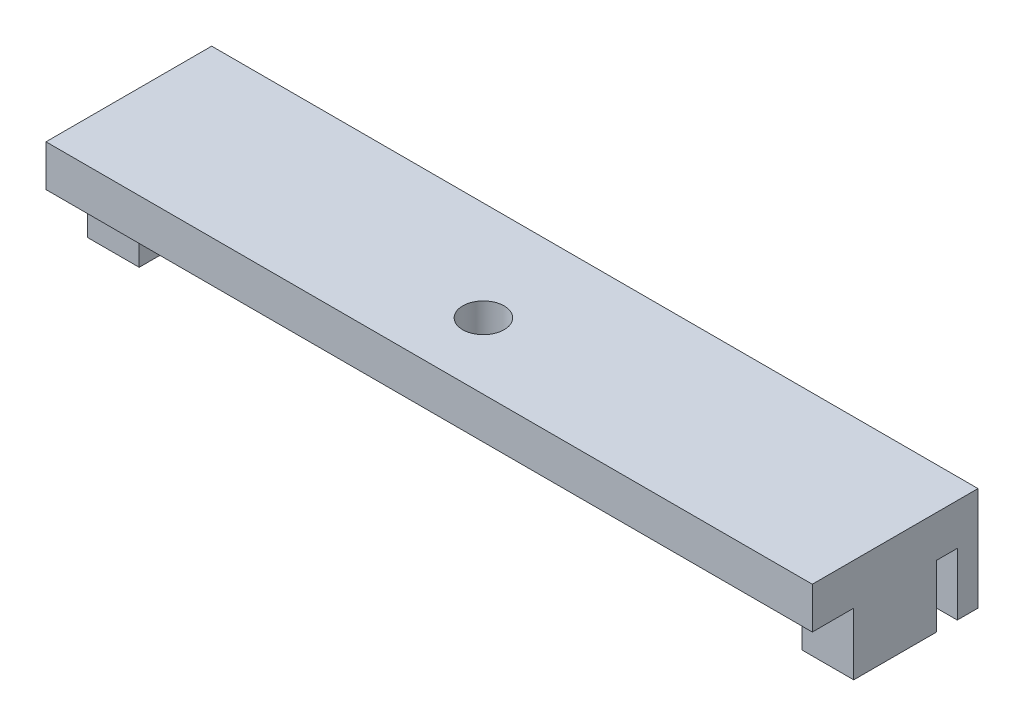
ISO-10303-21;
HEADER;
FILE_DESCRIPTION(('STEP AP214'),'2;1');
FILE_NAME('part.step','',(''),(''),'','','');
FILE_SCHEMA(('AUTOMOTIVE_DESIGN { 1 0 10303 214 1 1 1 1 }'));
ENDSEC;
DATA;
#1=APPLICATION_CONTEXT('core data for automotive mechanical design processes');
#2=APPLICATION_PROTOCOL_DEFINITION('international standard','automotive_design',2000,#1);
#3=PRODUCT_CONTEXT('',#1,'mechanical');
#4=PRODUCT('Part','Part','',(#3));
#5=PRODUCT_RELATED_PRODUCT_CATEGORY('part','',(#4));
#6=PRODUCT_DEFINITION_FORMATION('','',#4);
#7=PRODUCT_DEFINITION_CONTEXT('part definition',#1,'design');
#8=PRODUCT_DEFINITION('design','',#6,#7);
#9=PRODUCT_DEFINITION_SHAPE('','',#8);
#10=(LENGTH_UNIT() NAMED_UNIT(*) SI_UNIT(.MILLI.,.METRE.));
#11=(NAMED_UNIT(*) PLANE_ANGLE_UNIT() SI_UNIT($,.RADIAN.));
#12=(NAMED_UNIT(*) SI_UNIT($,.STERADIAN.) SOLID_ANGLE_UNIT());
#13=UNCERTAINTY_MEASURE_WITH_UNIT(LENGTH_MEASURE(1.E-05),#10,'distance_accuracy_value','');
#14=(GEOMETRIC_REPRESENTATION_CONTEXT(3) GLOBAL_UNCERTAINTY_ASSIGNED_CONTEXT((#13)) GLOBAL_UNIT_ASSIGNED_CONTEXT((#10,
#11,#12)) REPRESENTATION_CONTEXT('',''));
#15=CARTESIAN_POINT('',(0.,0.,0.));
#16=DIRECTION('',(0.,0.,1.));
#17=DIRECTION('',(1.,0.,0.));
#18=AXIS2_PLACEMENT_3D('',#15,#16,#17);
#19=CARTESIAN_POINT('',(0.,0.,0.));
#20=DIRECTION('',(0.,-1.,0.));
#21=DIRECTION('',(0.,0.,-1.));
#22=AXIS2_PLACEMENT_3D('',#19,#20,#21);
#23=PLANE('',#22);
#24=CARTESIAN_POINT('',(-0.579999999999994,0.,0.8));
#25=DIRECTION('',(0.,1.,0.));
#26=DIRECTION('',(0.,0.,1.));
#27=AXIS2_PLACEMENT_3D('',#24,#25,#26);
#28=CIRCLE('',#27,1.);
#29=CARTESIAN_POINT('',(-0.579999999999994,0.,1.8));
#30=VERTEX_POINT('',#29);
#31=EDGE_CURVE('E313',#30,#30,#28,.T.);
#32=ORIENTED_EDGE('',*,*,#31,.T.);
#33=EDGE_LOOP('',(#32));
#34=FACE_BOUND('',#33,.T.);
#35=DIRECTION('',(0.,0.,1.));
#36=VECTOR('',#35,1.);
#37=CARTESIAN_POINT('',(-16.,0.,2.));
#38=LINE('',#37,#36);
#39=CARTESIAN_POINT('',(-16.,0.,-2.));
#40=VERTEX_POINT('',#39);
#41=CARTESIAN_POINT('',(-16.,0.,2.));
#42=VERTEX_POINT('',#41);
#43=EDGE_CURVE('E171',#40,#42,#38,.T.);
#44=ORIENTED_EDGE('',*,*,#43,.F.);
#45=DIRECTION('',(1.,0.,0.));
#46=VECTOR('',#45,1.);
#47=CARTESIAN_POINT('',(-18.5,0.,-2.));
#48=LINE('',#47,#46);
#49=CARTESIAN_POINT('',(-18.5,0.,-2.));
#50=VERTEX_POINT('',#49);
#51=EDGE_CURVE('E183',#50,#40,#48,.T.);
#52=ORIENTED_EDGE('',*,*,#51,.F.);
#53=DIRECTION('',(0.,0.,1.));
#54=VECTOR('',#53,1.);
#55=CARTESIAN_POINT('',(-18.5,0.,4.));
#56=LINE('',#55,#54);
#57=CARTESIAN_POINT('',(-18.5,0.,-3.));
#58=VERTEX_POINT('',#57);
#59=EDGE_CURVE('E344',#58,#50,#56,.T.);
#60=ORIENTED_EDGE('',*,*,#59,.F.);
#61=DIRECTION('',(-1.,0.,0.));
#62=VECTOR('',#61,1.);
#63=CARTESIAN_POINT('',(-18.5,0.,-3.));
#64=LINE('',#63,#62);
#65=CARTESIAN_POINT('',(-16.,0.,-3.));
#66=VERTEX_POINT('',#65);
#67=EDGE_CURVE('E222',#66,#58,#64,.T.);
#68=ORIENTED_EDGE('',*,*,#67,.F.);
#69=DIRECTION('',(0.,0.,1.));
#70=VECTOR('',#69,1.);
#71=CARTESIAN_POINT('',(-16.,0.,-3.));
#72=LINE('',#71,#70);
#73=CARTESIAN_POINT('',(-16.,0.,-4.));
#74=VERTEX_POINT('',#73);
#75=EDGE_CURVE('E225',#74,#66,#72,.T.);
#76=ORIENTED_EDGE('',*,*,#75,.F.);
#77=DIRECTION('',(-1.,0.,0.));
#78=VECTOR('',#77,1.);
#79=CARTESIAN_POINT('',(-18.5,0.,-4.));
#80=LINE('',#79,#78);
#81=CARTESIAN_POINT('',(16.,0.,-4.));
#82=VERTEX_POINT('',#81);
#83=EDGE_CURVE('E340',#82,#74,#80,.T.);
#84=ORIENTED_EDGE('',*,*,#83,.F.);
#85=DIRECTION('',(0.,0.,-1.));
#86=VECTOR('',#85,1.);
#87=CARTESIAN_POINT('',(16.,0.,-3.));
#88=LINE('',#87,#86);
#89=CARTESIAN_POINT('',(16.,0.,-3.));
#90=VERTEX_POINT('',#89);
#91=EDGE_CURVE('E251',#90,#82,#88,.T.);
#92=ORIENTED_EDGE('',*,*,#91,.F.);
#93=DIRECTION('',(-1.,0.,0.));
#94=VECTOR('',#93,1.);
#95=CARTESIAN_POINT('',(18.5,0.,-3.));
#96=LINE('',#95,#94);
#97=CARTESIAN_POINT('',(18.5,0.,-3.));
#98=VERTEX_POINT('',#97);
#99=EDGE_CURVE('E255',#98,#90,#96,.T.);
#100=ORIENTED_EDGE('',*,*,#99,.F.);
#101=DIRECTION('',(0.,0.,-1.));
#102=VECTOR('',#101,1.);
#103=CARTESIAN_POINT('',(18.5,0.,4.));
#104=LINE('',#103,#102);
#105=CARTESIAN_POINT('',(18.5,0.,-2.));
#106=VERTEX_POINT('',#105);
#107=EDGE_CURVE('E317',#106,#98,#104,.T.);
#108=ORIENTED_EDGE('',*,*,#107,.F.);
#109=DIRECTION('',(1.,0.,0.));
#110=VECTOR('',#109,1.);
#111=CARTESIAN_POINT('',(18.5,0.,-2.));
#112=LINE('',#111,#110);
#113=CARTESIAN_POINT('',(16.,0.,-2.));
#114=VERTEX_POINT('',#113);
#115=EDGE_CURVE('E277',#114,#106,#112,.T.);
#116=ORIENTED_EDGE('',*,*,#115,.F.);
#117=DIRECTION('',(0.,0.,-1.));
#118=VECTOR('',#117,1.);
#119=CARTESIAN_POINT('',(16.,0.,2.));
#120=LINE('',#119,#118);
#121=CARTESIAN_POINT('',(16.,0.,2.));
#122=VERTEX_POINT('',#121);
#123=EDGE_CURVE('E290',#122,#114,#120,.T.);
#124=ORIENTED_EDGE('',*,*,#123,.F.);
#125=DIRECTION('',(-1.,0.,0.));
#126=VECTOR('',#125,1.);
#127=CARTESIAN_POINT('',(18.5,0.,2.));
#128=LINE('',#127,#126);
#129=CARTESIAN_POINT('',(18.5,0.,2.));
#130=VERTEX_POINT('',#129);
#131=EDGE_CURVE('E259',#130,#122,#128,.T.);
#132=ORIENTED_EDGE('',*,*,#131,.F.);
#133=CARTESIAN_POINT('',(18.5,0.,4.));
#134=VERTEX_POINT('',#133);
#135=EDGE_CURVE('E336',#134,#130,#104,.T.);
#136=ORIENTED_EDGE('',*,*,#135,.F.);
#137=DIRECTION('',(1.,0.,0.));
#138=VECTOR('',#137,1.);
#139=CARTESIAN_POINT('',(-18.5,0.,4.));
#140=LINE('',#139,#138);
#141=CARTESIAN_POINT('',(-18.5,0.,4.));
#142=VERTEX_POINT('',#141);
#143=EDGE_CURVE('E326',#142,#134,#140,.T.);
#144=ORIENTED_EDGE('',*,*,#143,.F.);
#145=CARTESIAN_POINT('',(-18.5,0.,2.));
#146=VERTEX_POINT('',#145);
#147=EDGE_CURVE('E193',#146,#142,#56,.T.);
#148=ORIENTED_EDGE('',*,*,#147,.F.);
#149=DIRECTION('',(-1.,0.,0.));
#150=VECTOR('',#149,1.);
#151=CARTESIAN_POINT('',(-18.5,0.,2.));
#152=LINE('',#151,#150);
#153=EDGE_CURVE('E184',#42,#146,#152,.T.);
#154=ORIENTED_EDGE('',*,*,#153,.F.);
#155=EDGE_LOOP('',(#44,#52,#60,#68,#76,#84,#92,#100,#108,#116,#124,#132,#136,#144,#148,#154));
#156=FACE_BOUND('',#155,.T.);
#157=ADVANCED_FACE('F43',(#34,#156),#23,.T.);
#158=CARTESIAN_POINT('',(18.5,2.,4.));
#159=DIRECTION('',(-1.,0.,0.));
#160=DIRECTION('',(0.,0.,1.));
#161=AXIS2_PLACEMENT_3D('',#158,#159,#160);
#162=PLANE('',#161);
#163=ORIENTED_EDGE('',*,*,#135,.T.);
#164=DIRECTION('',(0.,1.,0.));
#165=VECTOR('',#164,1.);
#166=CARTESIAN_POINT('',(18.5,-3.,2.));
#167=LINE('',#166,#165);
#168=CARTESIAN_POINT('',(18.5,-3.,2.));
#169=VERTEX_POINT('',#168);
#170=EDGE_CURVE('E308',#169,#130,#167,.T.);
#171=ORIENTED_EDGE('',*,*,#170,.F.);
#172=DIRECTION('',(0.,0.,1.));
#173=VECTOR('',#172,1.);
#174=CARTESIAN_POINT('',(18.5,-3.,2.));
#175=LINE('',#174,#173);
#176=CARTESIAN_POINT('',(18.5,-3.,-2.));
#177=VERTEX_POINT('',#176);
#178=EDGE_CURVE('E272',#177,#169,#175,.T.);
#179=ORIENTED_EDGE('',*,*,#178,.F.);
#180=DIRECTION('',(0.,1.,0.));
#181=VECTOR('',#180,1.);
#182=CARTESIAN_POINT('',(18.5,-3.,-2.));
#183=LINE('',#182,#181);
#184=EDGE_CURVE('E286',#177,#106,#183,.T.);
#185=ORIENTED_EDGE('',*,*,#184,.T.);
#186=ORIENTED_EDGE('',*,*,#107,.T.);
#187=DIRECTION('',(0.,1.,0.));
#188=VECTOR('',#187,1.);
#189=CARTESIAN_POINT('',(18.5,-3.,-3.));
#190=LINE('',#189,#188);
#191=CARTESIAN_POINT('',(18.5,-3.,-3.));
#192=VERTEX_POINT('',#191);
#193=EDGE_CURVE('E229',#192,#98,#190,.T.);
#194=ORIENTED_EDGE('',*,*,#193,.F.);
#195=DIRECTION('',(0.,0.,1.));
#196=VECTOR('',#195,1.);
#197=CARTESIAN_POINT('',(18.5,-3.,-3.));
#198=LINE('',#197,#196);
#199=CARTESIAN_POINT('',(18.5,-3.,-4.));
#200=VERTEX_POINT('',#199);
#201=EDGE_CURVE('E256',#200,#192,#198,.T.);
#202=ORIENTED_EDGE('',*,*,#201,.F.);
#203=DIRECTION('',(0.,-1.,0.));
#204=VECTOR('',#203,1.);
#205=CARTESIAN_POINT('',(18.5,2.,-4.));
#206=LINE('',#205,#204);
#207=CARTESIAN_POINT('',(18.5,2.,-4.));
#208=VERTEX_POINT('',#207);
#209=EDGE_CURVE('E11',#208,#200,#206,.T.);
#210=ORIENTED_EDGE('',*,*,#209,.F.);
#211=DIRECTION('',(0.,0.,-1.));
#212=VECTOR('',#211,1.);
#213=CARTESIAN_POINT('',(18.5,2.,4.));
#214=LINE('',#213,#212);
#215=CARTESIAN_POINT('',(18.5,2.,4.));
#216=VERTEX_POINT('',#215);
#217=EDGE_CURVE('E321',#216,#208,#214,.T.);
#218=ORIENTED_EDGE('',*,*,#217,.F.);
#219=DIRECTION('',(0.,-1.,0.));
#220=VECTOR('',#219,1.);
#221=CARTESIAN_POINT('',(18.5,2.,4.));
#222=LINE('',#221,#220);
#223=EDGE_CURVE('E335',#216,#134,#222,.T.);
#224=ORIENTED_EDGE('',*,*,#223,.T.);
#225=EDGE_LOOP('',(#163,#171,#179,#185,#186,#194,#202,#210,#218,#224));
#226=FACE_BOUND('',#225,.T.);
#227=ADVANCED_FACE('F45',(#226),#162,.F.);
#228=CARTESIAN_POINT('',(-18.5,2.,-4.));
#229=DIRECTION('',(0.,0.,1.));
#230=DIRECTION('',(1.,0.,0.));
#231=AXIS2_PLACEMENT_3D('',#228,#229,#230);
#232=PLANE('',#231);
#233=ORIENTED_EDGE('',*,*,#209,.T.);
#234=DIRECTION('',(1.,0.,0.));
#235=VECTOR('',#234,1.);
#236=CARTESIAN_POINT('',(18.5,-3.,-4.));
#237=LINE('',#236,#235);
#238=CARTESIAN_POINT('',(16.,-3.,-4.));
#239=VERTEX_POINT('',#238);
#240=EDGE_CURVE('E250',#239,#200,#237,.T.);
#241=ORIENTED_EDGE('',*,*,#240,.F.);
#242=DIRECTION('',(0.,1.,0.));
#243=VECTOR('',#242,1.);
#244=CARTESIAN_POINT('',(16.,-3.,-4.));
#245=LINE('',#244,#243);
#246=EDGE_CURVE('E247',#239,#82,#245,.T.);
#247=ORIENTED_EDGE('',*,*,#246,.T.);
#248=ORIENTED_EDGE('',*,*,#83,.T.);
#249=DIRECTION('',(0.,1.,0.));
#250=VECTOR('',#249,1.);
#251=CARTESIAN_POINT('',(-16.,-3.,-4.));
#252=LINE('',#251,#250);
#253=CARTESIAN_POINT('',(-16.,-3.,-4.));
#254=VERTEX_POINT('',#253);
#255=EDGE_CURVE('E205',#254,#74,#252,.T.);
#256=ORIENTED_EDGE('',*,*,#255,.F.);
#257=DIRECTION('',(1.,0.,0.));
#258=VECTOR('',#257,1.);
#259=CARTESIAN_POINT('',(-18.5,-3.,-4.));
#260=LINE('',#259,#258);
#261=CARTESIAN_POINT('',(-18.5,-3.,-4.));
#262=VERTEX_POINT('',#261);
#263=EDGE_CURVE('E235',#262,#254,#260,.T.);
#264=ORIENTED_EDGE('',*,*,#263,.F.);
#265=DIRECTION('',(0.,-1.,0.));
#266=VECTOR('',#265,1.);
#267=CARTESIAN_POINT('',(-18.5,2.,-4.));
#268=LINE('',#267,#266);
#269=CARTESIAN_POINT('',(-18.5,2.,-4.));
#270=VERTEX_POINT('',#269);
#271=EDGE_CURVE('E52',#270,#262,#268,.T.);
#272=ORIENTED_EDGE('',*,*,#271,.F.);
#273=DIRECTION('',(-1.,0.,0.));
#274=VECTOR('',#273,1.);
#275=CARTESIAN_POINT('',(-18.5,2.,-4.));
#276=LINE('',#275,#274);
#277=EDGE_CURVE('E325',#208,#270,#276,.T.);
#278=ORIENTED_EDGE('',*,*,#277,.F.);
#279=EDGE_LOOP('',(#233,#241,#247,#248,#256,#264,#272,#278));
#280=FACE_BOUND('',#279,.T.);
#281=ADVANCED_FACE('F363',(#280),#232,.F.);
#282=CARTESIAN_POINT('',(-18.5,2.,4.));
#283=DIRECTION('',(1.,0.,0.));
#284=DIRECTION('',(0.,0.,-1.));
#285=AXIS2_PLACEMENT_3D('',#282,#283,#284);
#286=PLANE('',#285);
#287=ORIENTED_EDGE('',*,*,#271,.T.);
#288=DIRECTION('',(0.,0.,-1.));
#289=VECTOR('',#288,1.);
#290=CARTESIAN_POINT('',(-18.5,-3.,-3.));
#291=LINE('',#290,#289);
#292=CARTESIAN_POINT('',(-18.5,-3.,-3.));
#293=VERTEX_POINT('',#292);
#294=EDGE_CURVE('E226',#293,#262,#291,.T.);
#295=ORIENTED_EDGE('',*,*,#294,.F.);
#296=DIRECTION('',(0.,1.,0.));
#297=VECTOR('',#296,1.);
#298=CARTESIAN_POINT('',(-18.5,-3.,-3.));
#299=LINE('',#298,#297);
#300=EDGE_CURVE('E66',#293,#58,#299,.T.);
#301=ORIENTED_EDGE('',*,*,#300,.T.);
#302=ORIENTED_EDGE('',*,*,#59,.T.);
#303=DIRECTION('',(0.,1.,0.));
#304=VECTOR('',#303,1.);
#305=CARTESIAN_POINT('',(-18.5,-3.,-2.));
#306=LINE('',#305,#304);
#307=CARTESIAN_POINT('',(-18.5,-3.,-2.));
#308=VERTEX_POINT('',#307);
#309=EDGE_CURVE('E375',#308,#50,#306,.T.);
#310=ORIENTED_EDGE('',*,*,#309,.F.);
#311=DIRECTION('',(0.,0.,-1.));
#312=VECTOR('',#311,1.);
#313=CARTESIAN_POINT('',(-18.5,-3.,2.));
#314=LINE('',#313,#312);
#315=CARTESIAN_POINT('',(-18.5,-3.,2.));
#316=VERTEX_POINT('',#315);
#317=EDGE_CURVE('E195',#316,#308,#314,.T.);
#318=ORIENTED_EDGE('',*,*,#317,.F.);
#319=DIRECTION('',(0.,1.,0.));
#320=VECTOR('',#319,1.);
#321=CARTESIAN_POINT('',(-18.5,-3.,2.));
#322=LINE('',#321,#320);
#323=EDGE_CURVE('E59',#316,#146,#322,.T.);
#324=ORIENTED_EDGE('',*,*,#323,.T.);
#325=ORIENTED_EDGE('',*,*,#147,.T.);
#326=DIRECTION('',(0.,-1.,0.));
#327=VECTOR('',#326,1.);
#328=CARTESIAN_POINT('',(-18.5,2.,4.));
#329=LINE('',#328,#327);
#330=CARTESIAN_POINT('',(-18.5,2.,4.));
#331=VERTEX_POINT('',#330);
#332=EDGE_CURVE('E352',#331,#142,#329,.T.);
#333=ORIENTED_EDGE('',*,*,#332,.F.);
#334=DIRECTION('',(0.,0.,1.));
#335=VECTOR('',#334,1.);
#336=CARTESIAN_POINT('',(-18.5,2.,4.));
#337=LINE('',#336,#335);
#338=EDGE_CURVE('E329',#270,#331,#337,.T.);
#339=ORIENTED_EDGE('',*,*,#338,.F.);
#340=EDGE_LOOP('',(#287,#295,#301,#302,#310,#318,#324,#325,#333,#339));
#341=FACE_BOUND('',#340,.T.);
#342=ADVANCED_FACE('F359',(#341),#286,.F.);
#343=CARTESIAN_POINT('',(-18.5,2.,4.));
#344=DIRECTION('',(0.,0.,-1.));
#345=DIRECTION('',(-1.,0.,0.));
#346=AXIS2_PLACEMENT_3D('',#343,#344,#345);
#347=PLANE('',#346);
#348=ORIENTED_EDGE('',*,*,#143,.T.);
#349=ORIENTED_EDGE('',*,*,#223,.F.);
#350=DIRECTION('',(1.,0.,0.));
#351=VECTOR('',#350,1.);
#352=CARTESIAN_POINT('',(-18.5,2.,4.));
#353=LINE('',#352,#351);
#354=EDGE_CURVE('E332',#331,#216,#353,.T.);
#355=ORIENTED_EDGE('',*,*,#354,.F.);
#356=ORIENTED_EDGE('',*,*,#332,.T.);
#357=EDGE_LOOP('',(#348,#349,#355,#356));
#358=FACE_BOUND('',#357,.T.);
#359=ADVANCED_FACE('F403',(#358),#347,.F.);
#360=CARTESIAN_POINT('',(0.,2.,0.));
#361=DIRECTION('',(0.,-1.,0.));
#362=DIRECTION('',(0.,0.,-1.));
#363=AXIS2_PLACEMENT_3D('',#360,#361,#362);
#364=PLANE('',#363);
#365=CARTESIAN_POINT('',(-0.579999999999994,2.,0.8));
#366=DIRECTION('',(0.,1.,0.));
#367=DIRECTION('',(0.,0.,1.));
#368=AXIS2_PLACEMENT_3D('',#365,#366,#367);
#369=CIRCLE('',#368,1.);
#370=CARTESIAN_POINT('',(-0.579999999999994,2.,1.8));
#371=VERTEX_POINT('',#370);
#372=EDGE_CURVE('E312',#371,#371,#369,.T.);
#373=ORIENTED_EDGE('',*,*,#372,.F.);
#374=EDGE_LOOP('',(#373));
#375=FACE_BOUND('',#374,.T.);
#376=ORIENTED_EDGE('',*,*,#217,.T.);
#377=ORIENTED_EDGE('',*,*,#277,.T.);
#378=ORIENTED_EDGE('',*,*,#338,.T.);
#379=ORIENTED_EDGE('',*,*,#354,.T.);
#380=EDGE_LOOP('',(#376,#377,#378,#379));
#381=FACE_BOUND('',#380,.T.);
#382=ADVANCED_FACE('F401',(#375,#381),#364,.F.);
#383=CARTESIAN_POINT('',(-0.579999999999994,0.,0.8));
#384=DIRECTION('',(0.,1.,0.));
#385=DIRECTION('',(0.,0.,1.));
#386=AXIS2_PLACEMENT_3D('',#383,#384,#385);
#387=CYLINDRICAL_SURFACE('',#386,1.);
#388=ORIENTED_EDGE('',*,*,#31,.F.);
#389=EDGE_LOOP('',(#388));
#390=FACE_BOUND('',#389,.T.);
#391=ORIENTED_EDGE('',*,*,#372,.T.);
#392=EDGE_LOOP('',(#391));
#393=FACE_BOUND('',#392,.T.);
#394=ADVANCED_FACE('F428',(#390,#393),#387,.F.);
#395=CARTESIAN_POINT('',(18.5,-3.,2.));
#396=DIRECTION('',(0.,0.,-1.));
#397=DIRECTION('',(-1.,0.,0.));
#398=AXIS2_PLACEMENT_3D('',#395,#396,#397);
#399=PLANE('',#398);
#400=ORIENTED_EDGE('',*,*,#131,.T.);
#401=DIRECTION('',(0.,1.,0.));
#402=VECTOR('',#401,1.);
#403=CARTESIAN_POINT('',(16.,-3.,2.));
#404=LINE('',#403,#402);
#405=CARTESIAN_POINT('',(16.,-3.,2.));
#406=VERTEX_POINT('',#405);
#407=EDGE_CURVE('E304',#406,#122,#404,.T.);
#408=ORIENTED_EDGE('',*,*,#407,.F.);
#409=DIRECTION('',(-1.,0.,0.));
#410=VECTOR('',#409,1.);
#411=CARTESIAN_POINT('',(18.5,-3.,2.));
#412=LINE('',#411,#410);
#413=EDGE_CURVE('E276',#169,#406,#412,.T.);
#414=ORIENTED_EDGE('',*,*,#413,.F.);
#415=ORIENTED_EDGE('',*,*,#170,.T.);
#416=EDGE_LOOP('',(#400,#408,#414,#415));
#417=FACE_BOUND('',#416,.T.);
#418=ADVANCED_FACE('F435',(#417),#399,.F.);
#419=CARTESIAN_POINT('',(16.,-3.,2.));
#420=DIRECTION('',(1.,0.,0.));
#421=DIRECTION('',(0.,0.,-1.));
#422=AXIS2_PLACEMENT_3D('',#419,#420,#421);
#423=PLANE('',#422);
#424=ORIENTED_EDGE('',*,*,#123,.T.);
#425=DIRECTION('',(0.,1.,0.));
#426=VECTOR('',#425,1.);
#427=CARTESIAN_POINT('',(16.,-3.,-2.));
#428=LINE('',#427,#426);
#429=CARTESIAN_POINT('',(16.,-3.,-2.));
#430=VERTEX_POINT('',#429);
#431=EDGE_CURVE('E300',#430,#114,#428,.T.);
#432=ORIENTED_EDGE('',*,*,#431,.F.);
#433=DIRECTION('',(0.,0.,-1.));
#434=VECTOR('',#433,1.);
#435=CARTESIAN_POINT('',(16.,-3.,2.));
#436=LINE('',#435,#434);
#437=EDGE_CURVE('E280',#406,#430,#436,.T.);
#438=ORIENTED_EDGE('',*,*,#437,.F.);
#439=ORIENTED_EDGE('',*,*,#407,.T.);
#440=EDGE_LOOP('',(#424,#432,#438,#439));
#441=FACE_BOUND('',#440,.T.);
#442=ADVANCED_FACE('F441',(#441),#423,.F.);
#443=CARTESIAN_POINT('',(18.5,-3.,-2.));
#444=DIRECTION('',(0.,0.,1.));
#445=DIRECTION('',(1.,0.,0.));
#446=AXIS2_PLACEMENT_3D('',#443,#444,#445);
#447=PLANE('',#446);
#448=ORIENTED_EDGE('',*,*,#115,.T.);
#449=ORIENTED_EDGE('',*,*,#184,.F.);
#450=DIRECTION('',(1.,0.,0.));
#451=VECTOR('',#450,1.);
#452=CARTESIAN_POINT('',(18.5,-3.,-2.));
#453=LINE('',#452,#451);
#454=EDGE_CURVE('E283',#430,#177,#453,.T.);
#455=ORIENTED_EDGE('',*,*,#454,.F.);
#456=ORIENTED_EDGE('',*,*,#431,.T.);
#457=EDGE_LOOP('',(#448,#449,#455,#456));
#458=FACE_BOUND('',#457,.T.);
#459=ADVANCED_FACE('F449',(#458),#447,.F.);
#460=CARTESIAN_POINT('',(0.,-3.,0.));
#461=DIRECTION('',(0.,1.,0.));
#462=DIRECTION('',(0.,0.,1.));
#463=AXIS2_PLACEMENT_3D('',#460,#461,#462);
#464=PLANE('',#463);
#465=ORIENTED_EDGE('',*,*,#178,.T.);
#466=ORIENTED_EDGE('',*,*,#413,.T.);
#467=ORIENTED_EDGE('',*,*,#437,.T.);
#468=ORIENTED_EDGE('',*,*,#454,.T.);
#469=EDGE_LOOP('',(#465,#466,#467,#468));
#470=FACE_BOUND('',#469,.T.);
#471=ADVANCED_FACE('F457',(#470),#464,.F.);
#472=CARTESIAN_POINT('',(18.5,-3.,-3.));
#473=DIRECTION('',(0.,0.,-1.));
#474=DIRECTION('',(-1.,0.,0.));
#475=AXIS2_PLACEMENT_3D('',#472,#473,#474);
#476=PLANE('',#475);
#477=ORIENTED_EDGE('',*,*,#99,.T.);
#478=DIRECTION('',(0.,1.,0.));
#479=VECTOR('',#478,1.);
#480=CARTESIAN_POINT('',(16.,-3.,-3.));
#481=LINE('',#480,#479);
#482=CARTESIAN_POINT('',(16.,-3.,-3.));
#483=VERTEX_POINT('',#482);
#484=EDGE_CURVE('E243',#483,#90,#481,.T.);
#485=ORIENTED_EDGE('',*,*,#484,.F.);
#486=DIRECTION('',(-1.,0.,0.));
#487=VECTOR('',#486,1.);
#488=CARTESIAN_POINT('',(18.5,-3.,-3.));
#489=LINE('',#488,#487);
#490=EDGE_CURVE('E266',#192,#483,#489,.T.);
#491=ORIENTED_EDGE('',*,*,#490,.F.);
#492=ORIENTED_EDGE('',*,*,#193,.T.);
#493=EDGE_LOOP('',(#477,#485,#491,#492));
#494=FACE_BOUND('',#493,.T.);
#495=ADVANCED_FACE('F465',(#494),#476,.F.);
#496=CARTESIAN_POINT('',(16.,-3.,-3.));
#497=DIRECTION('',(1.,0.,0.));
#498=DIRECTION('',(0.,0.,-1.));
#499=AXIS2_PLACEMENT_3D('',#496,#497,#498);
#500=PLANE('',#499);
#501=ORIENTED_EDGE('',*,*,#91,.T.);
#502=ORIENTED_EDGE('',*,*,#246,.F.);
#503=DIRECTION('',(0.,0.,-1.));
#504=VECTOR('',#503,1.);
#505=CARTESIAN_POINT('',(16.,-3.,-3.));
#506=LINE('',#505,#504);
#507=EDGE_CURVE('E263',#483,#239,#506,.T.);
#508=ORIENTED_EDGE('',*,*,#507,.F.);
#509=ORIENTED_EDGE('',*,*,#484,.T.);
#510=EDGE_LOOP('',(#501,#502,#508,#509));
#511=FACE_BOUND('',#510,.T.);
#512=ADVANCED_FACE('F473',(#511),#500,.F.);
#513=CARTESIAN_POINT('',(0.,-3.,0.));
#514=DIRECTION('',(0.,1.,0.));
#515=DIRECTION('',(0.,0.,1.));
#516=AXIS2_PLACEMENT_3D('',#513,#514,#515);
#517=PLANE('',#516);
#518=ORIENTED_EDGE('',*,*,#201,.T.);
#519=ORIENTED_EDGE('',*,*,#490,.T.);
#520=ORIENTED_EDGE('',*,*,#507,.T.);
#521=ORIENTED_EDGE('',*,*,#240,.T.);
#522=EDGE_LOOP('',(#518,#519,#520,#521));
#523=FACE_BOUND('',#522,.T.);
#524=ADVANCED_FACE('F481',(#523),#517,.F.);
#525=CARTESIAN_POINT('',(-16.,-3.,-3.));
#526=DIRECTION('',(-1.,0.,0.));
#527=DIRECTION('',(0.,0.,1.));
#528=AXIS2_PLACEMENT_3D('',#525,#526,#527);
#529=PLANE('',#528);
#530=ORIENTED_EDGE('',*,*,#75,.T.);
#531=DIRECTION('',(0.,1.,0.));
#532=VECTOR('',#531,1.);
#533=CARTESIAN_POINT('',(-16.,-3.,-3.));
#534=LINE('',#533,#532);
#535=CARTESIAN_POINT('',(-16.,-3.,-3.));
#536=VERTEX_POINT('',#535);
#537=EDGE_CURVE('E215',#536,#66,#534,.T.);
#538=ORIENTED_EDGE('',*,*,#537,.F.);
#539=DIRECTION('',(0.,0.,1.));
#540=VECTOR('',#539,1.);
#541=CARTESIAN_POINT('',(-16.,-3.,-3.));
#542=LINE('',#541,#540);
#543=EDGE_CURVE('E232',#254,#536,#542,.T.);
#544=ORIENTED_EDGE('',*,*,#543,.F.);
#545=ORIENTED_EDGE('',*,*,#255,.T.);
#546=EDGE_LOOP('',(#530,#538,#544,#545));
#547=FACE_BOUND('',#546,.T.);
#548=ADVANCED_FACE('F489',(#547),#529,.F.);
#549=CARTESIAN_POINT('',(-18.5,-3.,-3.));
#550=DIRECTION('',(0.,0.,-1.));
#551=DIRECTION('',(-1.,0.,0.));
#552=AXIS2_PLACEMENT_3D('',#549,#550,#551);
#553=PLANE('',#552);
#554=ORIENTED_EDGE('',*,*,#67,.T.);
#555=ORIENTED_EDGE('',*,*,#300,.F.);
#556=DIRECTION('',(-1.,0.,0.));
#557=VECTOR('',#556,1.);
#558=CARTESIAN_POINT('',(-18.5,-3.,-3.));
#559=LINE('',#558,#557);
#560=EDGE_CURVE('E221',#536,#293,#559,.T.);
#561=ORIENTED_EDGE('',*,*,#560,.F.);
#562=ORIENTED_EDGE('',*,*,#537,.T.);
#563=EDGE_LOOP('',(#554,#555,#561,#562));
#564=FACE_BOUND('',#563,.T.);
#565=ADVANCED_FACE('F370',(#564),#553,.F.);
#566=CARTESIAN_POINT('',(0.,-3.,0.));
#567=DIRECTION('',(0.,-1.,0.));
#568=DIRECTION('',(0.,0.,-1.));
#569=AXIS2_PLACEMENT_3D('',#566,#567,#568);
#570=PLANE('',#569);
#571=ORIENTED_EDGE('',*,*,#294,.T.);
#572=ORIENTED_EDGE('',*,*,#263,.T.);
#573=ORIENTED_EDGE('',*,*,#543,.T.);
#574=ORIENTED_EDGE('',*,*,#560,.T.);
#575=EDGE_LOOP('',(#571,#572,#573,#574));
#576=FACE_BOUND('',#575,.T.);
#577=ADVANCED_FACE('F366',(#576),#570,.T.);
#578=CARTESIAN_POINT('',(-18.5,-3.,-2.));
#579=DIRECTION('',(0.,0.,1.));
#580=DIRECTION('',(1.,0.,0.));
#581=AXIS2_PLACEMENT_3D('',#578,#579,#580);
#582=PLANE('',#581);
#583=ORIENTED_EDGE('',*,*,#51,.T.);
#584=DIRECTION('',(0.,1.,0.));
#585=VECTOR('',#584,1.);
#586=CARTESIAN_POINT('',(-16.,-3.,-2.));
#587=LINE('',#586,#585);
#588=CARTESIAN_POINT('',(-16.,-3.,-2.));
#589=VERTEX_POINT('',#588);
#590=EDGE_CURVE('E178',#589,#40,#587,.T.);
#591=ORIENTED_EDGE('',*,*,#590,.F.);
#592=DIRECTION('',(1.,0.,0.));
#593=VECTOR('',#592,1.);
#594=CARTESIAN_POINT('',(-18.5,-3.,-2.));
#595=LINE('',#594,#593);
#596=EDGE_CURVE('E199',#308,#589,#595,.T.);
#597=ORIENTED_EDGE('',*,*,#596,.F.);
#598=ORIENTED_EDGE('',*,*,#309,.T.);
#599=EDGE_LOOP('',(#583,#591,#597,#598));
#600=FACE_BOUND('',#599,.T.);
#601=ADVANCED_FACE('F382',(#600),#582,.F.);
#602=CARTESIAN_POINT('',(-16.,-3.,2.));
#603=DIRECTION('',(-1.,0.,0.));
#604=DIRECTION('',(0.,0.,1.));
#605=AXIS2_PLACEMENT_3D('',#602,#603,#604);
#606=PLANE('',#605);
#607=ORIENTED_EDGE('',*,*,#43,.T.);
#608=DIRECTION('',(0.,1.,0.));
#609=VECTOR('',#608,1.);
#610=CARTESIAN_POINT('',(-16.,-3.,2.));
#611=LINE('',#610,#609);
#612=CARTESIAN_POINT('',(-16.,-3.,2.));
#613=VERTEX_POINT('',#612);
#614=EDGE_CURVE('E175',#613,#42,#611,.T.);
#615=ORIENTED_EDGE('',*,*,#614,.F.);
#616=DIRECTION('',(0.,0.,1.));
#617=VECTOR('',#616,1.);
#618=CARTESIAN_POINT('',(-16.,-3.,2.));
#619=LINE('',#618,#617);
#620=EDGE_CURVE('E208',#589,#613,#619,.T.);
#621=ORIENTED_EDGE('',*,*,#620,.F.);
#622=ORIENTED_EDGE('',*,*,#590,.T.);
#623=EDGE_LOOP('',(#607,#615,#621,#622));
#624=FACE_BOUND('',#623,.T.);
#625=ADVANCED_FACE('F173',(#624),#606,.F.);
#626=CARTESIAN_POINT('',(-18.5,-3.,2.));
#627=DIRECTION('',(0.,0.,-1.));
#628=DIRECTION('',(-1.,0.,0.));
#629=AXIS2_PLACEMENT_3D('',#626,#627,#628);
#630=PLANE('',#629);
#631=ORIENTED_EDGE('',*,*,#153,.T.);
#632=ORIENTED_EDGE('',*,*,#323,.F.);
#633=DIRECTION('',(-1.,0.,0.));
#634=VECTOR('',#633,1.);
#635=CARTESIAN_POINT('',(-18.5,-3.,2.));
#636=LINE('',#635,#634);
#637=EDGE_CURVE('E189',#613,#316,#636,.T.);
#638=ORIENTED_EDGE('',*,*,#637,.F.);
#639=ORIENTED_EDGE('',*,*,#614,.T.);
#640=EDGE_LOOP('',(#631,#632,#638,#639));
#641=FACE_BOUND('',#640,.T.);
#642=ADVANCED_FACE('F187',(#641),#630,.F.);
#643=CARTESIAN_POINT('',(0.,-3.,0.));
#644=DIRECTION('',(0.,-1.,0.));
#645=DIRECTION('',(0.,0.,-1.));
#646=AXIS2_PLACEMENT_3D('',#643,#644,#645);
#647=PLANE('',#646);
#648=ORIENTED_EDGE('',*,*,#317,.T.);
#649=ORIENTED_EDGE('',*,*,#596,.T.);
#650=ORIENTED_EDGE('',*,*,#620,.T.);
#651=ORIENTED_EDGE('',*,*,#637,.T.);
#652=EDGE_LOOP('',(#648,#649,#650,#651));
#653=FACE_BOUND('',#652,.T.);
#654=ADVANCED_FACE('F384',(#653),#647,.T.);
#655=CLOSED_SHELL('',(#157,#227,#281,#342,#359,#382,#394,#418,#442,#459,#471,#495,#512,#524,
#548,#565,#577,#601,#625,#642,#654));
#656=MANIFOLD_SOLID_BREP('B2',#655);
#657=ADVANCED_BREP_SHAPE_REPRESENTATION('',(#18,#656),#14);
#658=SHAPE_DEFINITION_REPRESENTATION(#9,#657);
ENDSEC;
END-ISO-10303-21;
